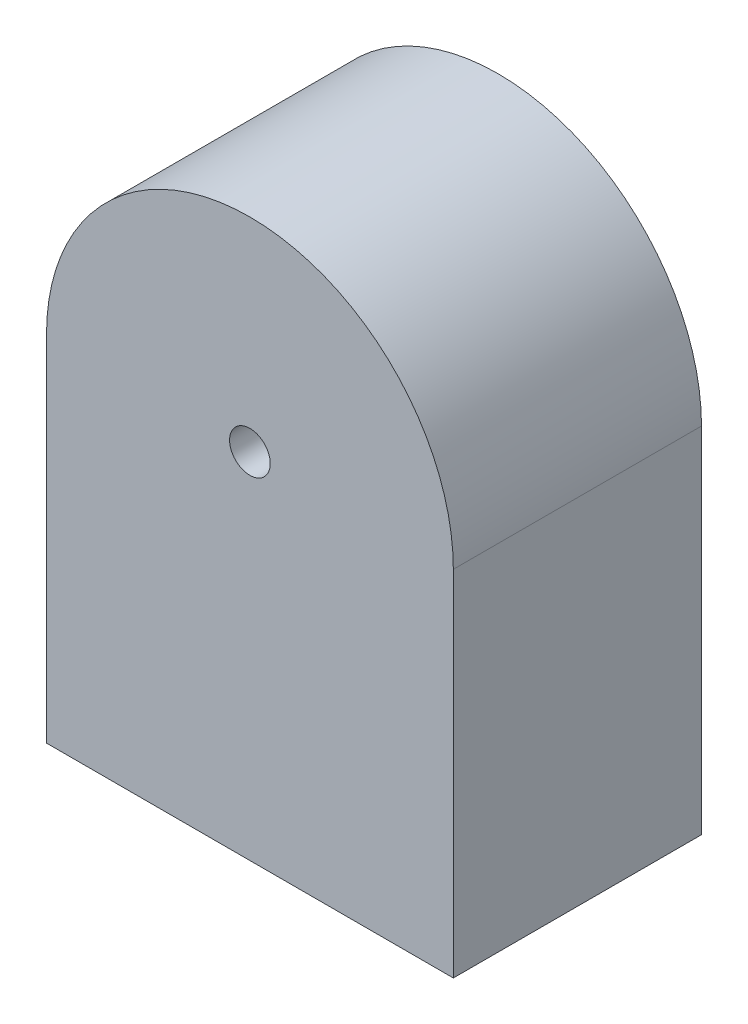
ISO-10303-21;
HEADER;
FILE_DESCRIPTION(('STEP AP214'),'2;1');
FILE_NAME('part.step','',(''),(''),'','','');
FILE_SCHEMA(('AUTOMOTIVE_DESIGN { 1 0 10303 214 1 1 1 1 }'));
ENDSEC;
DATA;
#1=APPLICATION_CONTEXT('core data for automotive mechanical design processes');
#2=APPLICATION_PROTOCOL_DEFINITION('international standard','automotive_design',2000,#1);
#3=PRODUCT_CONTEXT('',#1,'mechanical');
#4=PRODUCT('Part','Part','',(#3));
#5=PRODUCT_RELATED_PRODUCT_CATEGORY('part','',(#4));
#6=PRODUCT_DEFINITION_FORMATION('','',#4);
#7=PRODUCT_DEFINITION_CONTEXT('part definition',#1,'design');
#8=PRODUCT_DEFINITION('design','',#6,#7);
#9=PRODUCT_DEFINITION_SHAPE('','',#8);
#10=(LENGTH_UNIT() NAMED_UNIT(*) SI_UNIT(.MILLI.,.METRE.));
#11=(NAMED_UNIT(*) PLANE_ANGLE_UNIT() SI_UNIT($,.RADIAN.));
#12=(NAMED_UNIT(*) SI_UNIT($,.STERADIAN.) SOLID_ANGLE_UNIT());
#13=UNCERTAINTY_MEASURE_WITH_UNIT(LENGTH_MEASURE(1.E-05),#10,'distance_accuracy_value','');
#14=(GEOMETRIC_REPRESENTATION_CONTEXT(3) GLOBAL_UNCERTAINTY_ASSIGNED_CONTEXT((#13)) GLOBAL_UNIT_ASSIGNED_CONTEXT((#10,
#11,#12)) REPRESENTATION_CONTEXT('',''));
#15=CARTESIAN_POINT('',(0.,0.,0.));
#16=DIRECTION('',(0.,0.,1.));
#17=DIRECTION('',(1.,0.,0.));
#18=AXIS2_PLACEMENT_3D('',#15,#16,#17);
#19=CARTESIAN_POINT('',(0.,0.,18.3));
#20=DIRECTION('',(0.,0.,1.));
#21=DIRECTION('',(1.,0.,0.));
#22=AXIS2_PLACEMENT_3D('',#19,#20,#21);
#23=PLANE('',#22);
#24=CARTESIAN_POINT('',(0.,0.,18.3));
#25=DIRECTION('',(0.,0.,1.));
#26=DIRECTION('',(1.,0.,0.));
#27=AXIS2_PLACEMENT_3D('',#24,#25,#26);
#28=CIRCLE('',#27,15.);
#29=CARTESIAN_POINT('',(15.,0.,18.3));
#30=VERTEX_POINT('',#29);
#31=CARTESIAN_POINT('',(-15.,0.,18.3));
#32=VERTEX_POINT('',#31);
#33=EDGE_CURVE('E92',#30,#32,#28,.T.);
#34=ORIENTED_EDGE('',*,*,#33,.T.);
#35=DIRECTION('',(0.,-1.,0.));
#36=VECTOR('',#35,1.);
#37=CARTESIAN_POINT('',(-15.,0.,18.3));
#38=LINE('',#37,#36);
#39=CARTESIAN_POINT('',(-15.,-26.1,18.3));
#40=VERTEX_POINT('',#39);
#41=EDGE_CURVE('E87',#32,#40,#38,.T.);
#42=ORIENTED_EDGE('',*,*,#41,.T.);
#43=DIRECTION('',(1.,0.,0.));
#44=VECTOR('',#43,1.);
#45=CARTESIAN_POINT('',(-15.,-26.1,18.3));
#46=LINE('',#45,#44);
#47=CARTESIAN_POINT('',(15.,-26.1,18.3));
#48=VERTEX_POINT('',#47);
#49=EDGE_CURVE('E90',#40,#48,#46,.T.);
#50=ORIENTED_EDGE('',*,*,#49,.T.);
#51=DIRECTION('',(0.,1.,0.));
#52=VECTOR('',#51,1.);
#53=CARTESIAN_POINT('',(15.,-26.1,18.3));
#54=LINE('',#53,#52);
#55=EDGE_CURVE('E57',#48,#30,#54,.T.);
#56=ORIENTED_EDGE('',*,*,#55,.T.);
#57=EDGE_LOOP('',(#34,#42,#50,#56));
#58=FACE_BOUND('',#57,.T.);
#59=CARTESIAN_POINT('',(0.,0.,18.3));
#60=DIRECTION('',(0.,0.,1.));
#61=DIRECTION('',(1.,0.,0.));
#62=AXIS2_PLACEMENT_3D('',#59,#60,#61);
#63=CIRCLE('',#62,1.5);
#64=CARTESIAN_POINT('',(1.5,0.,18.3));
#65=VERTEX_POINT('',#64);
#66=EDGE_CURVE('E112',#65,#65,#63,.T.);
#67=ORIENTED_EDGE('',*,*,#66,.F.);
#68=EDGE_LOOP('',(#67));
#69=FACE_BOUND('',#68,.T.);
#70=ADVANCED_FACE('F39',(#58,#69),#23,.T.);
#71=CARTESIAN_POINT('',(0.,0.,0.));
#72=DIRECTION('',(0.,0.,1.));
#73=DIRECTION('',(1.,0.,0.));
#74=AXIS2_PLACEMENT_3D('',#71,#72,#73);
#75=PLANE('',#74);
#76=CARTESIAN_POINT('',(0.,0.,0.));
#77=DIRECTION('',(0.,0.,1.));
#78=DIRECTION('',(1.,0.,0.));
#79=AXIS2_PLACEMENT_3D('',#76,#77,#78);
#80=CIRCLE('',#79,15.);
#81=CARTESIAN_POINT('',(15.,0.,0.));
#82=VERTEX_POINT('',#81);
#83=CARTESIAN_POINT('',(-15.,0.,0.));
#84=VERTEX_POINT('',#83);
#85=EDGE_CURVE('E108',#82,#84,#80,.T.);
#86=ORIENTED_EDGE('',*,*,#85,.F.);
#87=DIRECTION('',(0.,1.,0.));
#88=VECTOR('',#87,1.);
#89=CARTESIAN_POINT('',(15.,-26.1,0.));
#90=LINE('',#89,#88);
#91=CARTESIAN_POINT('',(15.,-26.1,0.));
#92=VERTEX_POINT('',#91);
#93=EDGE_CURVE('E80',#92,#82,#90,.T.);
#94=ORIENTED_EDGE('',*,*,#93,.F.);
#95=DIRECTION('',(1.,0.,0.));
#96=VECTOR('',#95,1.);
#97=CARTESIAN_POINT('',(-15.,-26.1,0.));
#98=LINE('',#97,#96);
#99=CARTESIAN_POINT('',(-15.,-26.1,0.));
#100=VERTEX_POINT('',#99);
#101=EDGE_CURVE('E74',#100,#92,#98,.T.);
#102=ORIENTED_EDGE('',*,*,#101,.F.);
#103=DIRECTION('',(0.,-1.,0.));
#104=VECTOR('',#103,1.);
#105=CARTESIAN_POINT('',(-15.,0.,0.));
#106=LINE('',#105,#104);
#107=EDGE_CURVE('E97',#84,#100,#106,.T.);
#108=ORIENTED_EDGE('',*,*,#107,.F.);
#109=EDGE_LOOP('',(#86,#94,#102,#108));
#110=FACE_BOUND('',#109,.T.);
#111=CARTESIAN_POINT('',(0.,0.,0.));
#112=DIRECTION('',(0.,0.,1.));
#113=DIRECTION('',(1.,0.,0.));
#114=AXIS2_PLACEMENT_3D('',#111,#112,#113);
#115=CIRCLE('',#114,1.5);
#116=CARTESIAN_POINT('',(1.5,0.,0.));
#117=VERTEX_POINT('',#116);
#118=EDGE_CURVE('E130',#117,#117,#115,.T.);
#119=ORIENTED_EDGE('',*,*,#118,.T.);
#120=EDGE_LOOP('',(#119));
#121=FACE_BOUND('',#120,.T.);
#122=ADVANCED_FACE('F125',(#110,#121),#75,.F.);
#123=CARTESIAN_POINT('',(0.,0.,18.3));
#124=DIRECTION('',(0.,0.,-1.));
#125=DIRECTION('',(-1.,0.,0.));
#126=AXIS2_PLACEMENT_3D('',#123,#124,#125);
#127=CYLINDRICAL_SURFACE('',#126,15.);
#128=ORIENTED_EDGE('',*,*,#85,.T.);
#129=DIRECTION('',(0.,0.,-1.));
#130=VECTOR('',#129,1.);
#131=CARTESIAN_POINT('',(-15.,0.,18.3));
#132=LINE('',#131,#130);
#133=EDGE_CURVE('E11',#32,#84,#132,.T.);
#134=ORIENTED_EDGE('',*,*,#133,.F.);
#135=ORIENTED_EDGE('',*,*,#33,.F.);
#136=DIRECTION('',(0.,0.,-1.));
#137=VECTOR('',#136,1.);
#138=CARTESIAN_POINT('',(15.,0.,18.3));
#139=LINE('',#138,#137);
#140=EDGE_CURVE('E104',#30,#82,#139,.T.);
#141=ORIENTED_EDGE('',*,*,#140,.T.);
#142=EDGE_LOOP('',(#128,#134,#135,#141));
#143=FACE_BOUND('',#142,.T.);
#144=ADVANCED_FACE('F41',(#143),#127,.T.);
#145=CARTESIAN_POINT('',(-15.,0.,18.3));
#146=DIRECTION('',(1.,0.,0.));
#147=DIRECTION('',(0.,1.,0.));
#148=AXIS2_PLACEMENT_3D('',#145,#146,#147);
#149=PLANE('',#148);
#150=ORIENTED_EDGE('',*,*,#107,.T.);
#151=DIRECTION('',(0.,0.,-1.));
#152=VECTOR('',#151,1.);
#153=CARTESIAN_POINT('',(-15.,-26.1,18.3));
#154=LINE('',#153,#152);
#155=EDGE_CURVE('E49',#40,#100,#154,.T.);
#156=ORIENTED_EDGE('',*,*,#155,.F.);
#157=ORIENTED_EDGE('',*,*,#41,.F.);
#158=ORIENTED_EDGE('',*,*,#133,.T.);
#159=EDGE_LOOP('',(#150,#156,#157,#158));
#160=FACE_BOUND('',#159,.T.);
#161=ADVANCED_FACE('F96',(#160),#149,.F.);
#162=CARTESIAN_POINT('',(-15.,-26.1,18.3));
#163=DIRECTION('',(0.,1.,0.));
#164=DIRECTION('',(0.,0.,1.));
#165=AXIS2_PLACEMENT_3D('',#162,#163,#164);
#166=PLANE('',#165);
#167=ORIENTED_EDGE('',*,*,#101,.T.);
#168=DIRECTION('',(0.,0.,-1.));
#169=VECTOR('',#168,1.);
#170=CARTESIAN_POINT('',(15.,-26.1,18.3));
#171=LINE('',#170,#169);
#172=EDGE_CURVE('E99',#48,#92,#171,.T.);
#173=ORIENTED_EDGE('',*,*,#172,.F.);
#174=ORIENTED_EDGE('',*,*,#49,.F.);
#175=ORIENTED_EDGE('',*,*,#155,.T.);
#176=EDGE_LOOP('',(#167,#173,#174,#175));
#177=FACE_BOUND('',#176,.T.);
#178=ADVANCED_FACE('F100',(#177),#166,.F.);
#179=CARTESIAN_POINT('',(15.,-26.1,18.3));
#180=DIRECTION('',(-1.,0.,0.));
#181=DIRECTION('',(0.,-1.,0.));
#182=AXIS2_PLACEMENT_3D('',#179,#180,#181);
#183=PLANE('',#182);
#184=ORIENTED_EDGE('',*,*,#93,.T.);
#185=ORIENTED_EDGE('',*,*,#140,.F.);
#186=ORIENTED_EDGE('',*,*,#55,.F.);
#187=ORIENTED_EDGE('',*,*,#172,.T.);
#188=EDGE_LOOP('',(#184,#185,#186,#187));
#189=FACE_BOUND('',#188,.T.);
#190=ADVANCED_FACE('F122',(#189),#183,.F.);
#191=CARTESIAN_POINT('',(0.,0.,18.3));
#192=DIRECTION('',(0.,0.,-1.));
#193=DIRECTION('',(-1.,0.,0.));
#194=AXIS2_PLACEMENT_3D('',#191,#192,#193);
#195=CYLINDRICAL_SURFACE('',#194,1.5);
#196=ORIENTED_EDGE('',*,*,#66,.T.);
#197=EDGE_LOOP('',(#196));
#198=FACE_BOUND('',#197,.T.);
#199=ORIENTED_EDGE('',*,*,#118,.F.);
#200=EDGE_LOOP('',(#199));
#201=FACE_BOUND('',#200,.T.);
#202=ADVANCED_FACE('F138',(#198,#201),#195,.F.);
#203=CLOSED_SHELL('',(#70,#122,#144,#161,#178,#190,#202));
#204=MANIFOLD_SOLID_BREP('B2',#203);
#205=ADVANCED_BREP_SHAPE_REPRESENTATION('',(#18,#204),#14);
#206=SHAPE_DEFINITION_REPRESENTATION(#9,#205);
ENDSEC;
END-ISO-10303-21;
